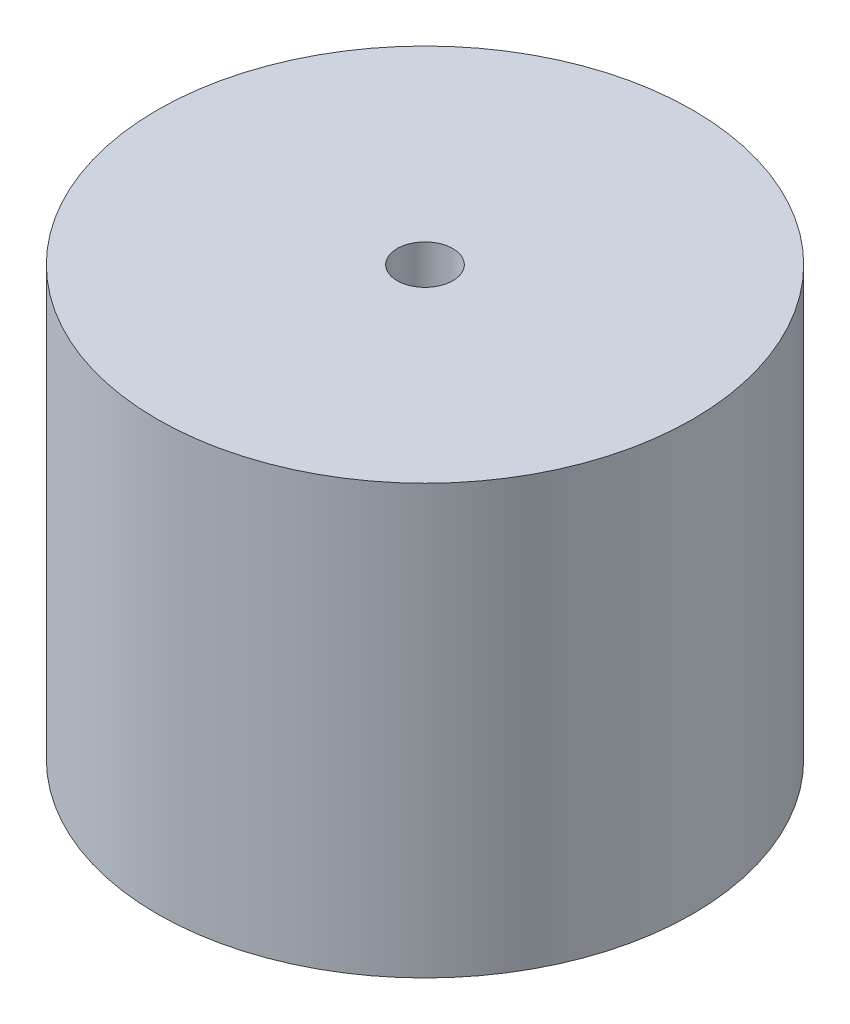
ISO-10303-21;
HEADER;
FILE_DESCRIPTION(('STEP AP214'),'2;1');
FILE_NAME('part.step','',(''),(''),'','','');
FILE_SCHEMA(('AUTOMOTIVE_DESIGN { 1 0 10303 214 1 1 1 1 }'));
ENDSEC;
DATA;
#1=APPLICATION_CONTEXT('core data for automotive mechanical design processes');
#2=APPLICATION_PROTOCOL_DEFINITION('international standard','automotive_design',2000,#1);
#3=PRODUCT_CONTEXT('',#1,'mechanical');
#4=PRODUCT('Part','Part','',(#3));
#5=PRODUCT_RELATED_PRODUCT_CATEGORY('part','',(#4));
#6=PRODUCT_DEFINITION_FORMATION('','',#4);
#7=PRODUCT_DEFINITION_CONTEXT('part definition',#1,'design');
#8=PRODUCT_DEFINITION('design','',#6,#7);
#9=PRODUCT_DEFINITION_SHAPE('','',#8);
#10=(LENGTH_UNIT() NAMED_UNIT(*) SI_UNIT(.MILLI.,.METRE.));
#11=(NAMED_UNIT(*) PLANE_ANGLE_UNIT() SI_UNIT($,.RADIAN.));
#12=(NAMED_UNIT(*) SI_UNIT($,.STERADIAN.) SOLID_ANGLE_UNIT());
#13=UNCERTAINTY_MEASURE_WITH_UNIT(LENGTH_MEASURE(1.E-05),#10,'distance_accuracy_value','');
#14=(GEOMETRIC_REPRESENTATION_CONTEXT(3) GLOBAL_UNCERTAINTY_ASSIGNED_CONTEXT((#13)) GLOBAL_UNIT_ASSIGNED_CONTEXT((#10,
#11,#12)) REPRESENTATION_CONTEXT('',''));
#15=CARTESIAN_POINT('',(0.,0.,0.));
#16=DIRECTION('',(0.,0.,1.));
#17=DIRECTION('',(1.,0.,0.));
#18=AXIS2_PLACEMENT_3D('',#15,#16,#17);
#19=CARTESIAN_POINT('',(-32.4400010499558,2.54,6.2787098806366));
#20=DIRECTION('',(0.,1.,0.));
#21=DIRECTION('',(0.,0.,1.));
#22=AXIS2_PLACEMENT_3D('',#19,#20,#21);
#23=PLANE('',#22);
#24=CARTESIAN_POINT('',(-32.4400010499558,2.54,6.2787098806366));
#25=DIRECTION('',(0.,1.,0.));
#26=DIRECTION('',(0.,0.,1.));
#27=AXIS2_PLACEMENT_3D('',#24,#25,#26);
#28=CIRCLE('',#27,3.175);
#29=CARTESIAN_POINT('',(-32.4400010499558,2.54,9.4537098806366));
#30=VERTEX_POINT('',#29);
#31=EDGE_CURVE('E10',#30,#30,#28,.T.);
#32=ORIENTED_EDGE('',*,*,#31,.T.);
#33=EDGE_LOOP('',(#32));
#34=FACE_BOUND('',#33,.T.);
#35=CARTESIAN_POINT('',(-32.4400010499558,2.54,6.2787098806366));
#36=DIRECTION('',(0.,1.,0.));
#37=DIRECTION('',(0.,0.,1.));
#38=AXIS2_PLACEMENT_3D('',#35,#36,#37);
#39=CIRCLE('',#38,0.330200000000003);
#40=CARTESIAN_POINT('',(-32.4400010499558,2.54,6.6089098806366));
#41=VERTEX_POINT('',#40);
#42=EDGE_CURVE('E38',#41,#41,#39,.T.);
#43=ORIENTED_EDGE('',*,*,#42,.F.);
#44=EDGE_LOOP('',(#43));
#45=FACE_BOUND('',#44,.T.);
#46=ADVANCED_FACE('F31',(#34,#45),#23,.T.);
#47=CARTESIAN_POINT('',(-32.4400010499558,2.54,6.2787098806366));
#48=DIRECTION('',(0.,-1.,0.));
#49=DIRECTION('',(0.,0.,-1.));
#50=AXIS2_PLACEMENT_3D('',#47,#48,#49);
#51=CYLINDRICAL_SURFACE('',#50,3.175);
#52=ORIENTED_EDGE('',*,*,#31,.F.);
#53=EDGE_LOOP('',(#52));
#54=FACE_BOUND('',#53,.T.);
#55=CARTESIAN_POINT('',(-32.4400010499558,-2.54,6.2787098806366));
#56=DIRECTION('',(0.,-1.,0.));
#57=DIRECTION('',(0.,0.,-1.));
#58=AXIS2_PLACEMENT_3D('',#55,#56,#57);
#59=CIRCLE('',#58,3.175);
#60=CARTESIAN_POINT('',(-32.4400010499558,-2.54,3.1037098806366));
#61=VERTEX_POINT('',#60);
#62=EDGE_CURVE('E47',#61,#61,#59,.T.);
#63=ORIENTED_EDGE('',*,*,#62,.F.);
#64=EDGE_LOOP('',(#63));
#65=FACE_BOUND('',#64,.T.);
#66=ADVANCED_FACE('F33',(#54,#65),#51,.T.);
#67=CARTESIAN_POINT('',(-32.4400010499558,2.54,6.2787098806366));
#68=DIRECTION('',(0.,-1.,0.));
#69=DIRECTION('',(0.,0.,-1.));
#70=AXIS2_PLACEMENT_3D('',#67,#68,#69);
#71=CYLINDRICAL_SURFACE('',#70,0.330200000000003);
#72=ORIENTED_EDGE('',*,*,#42,.T.);
#73=EDGE_LOOP('',(#72));
#74=FACE_BOUND('',#73,.T.);
#75=CARTESIAN_POINT('',(-32.4400010499558,0.,6.2787098806366));
#76=DIRECTION('',(0.,1.,0.));
#77=DIRECTION('',(0.,0.,1.));
#78=AXIS2_PLACEMENT_3D('',#75,#76,#77);
#79=CIRCLE('',#78,0.330200000000003);
#80=CARTESIAN_POINT('',(-32.4400010499558,0.,6.6089098806366));
#81=VERTEX_POINT('',#80);
#82=EDGE_CURVE('E42',#81,#81,#79,.T.);
#83=ORIENTED_EDGE('',*,*,#82,.F.);
#84=EDGE_LOOP('',(#83));
#85=FACE_BOUND('',#84,.T.);
#86=ADVANCED_FACE('F55',(#74,#85),#71,.F.);
#87=CARTESIAN_POINT('',(-32.4400010499558,0.,6.2787098806366));
#88=DIRECTION('',(0.,-1.,0.));
#89=DIRECTION('',(0.,0.,-1.));
#90=AXIS2_PLACEMENT_3D('',#87,#88,#89);
#91=PLANE('',#90);
#92=ORIENTED_EDGE('',*,*,#82,.T.);
#93=EDGE_LOOP('',(#92));
#94=FACE_BOUND('',#93,.T.);
#95=ADVANCED_FACE('F61',(#94),#91,.F.);
#96=CARTESIAN_POINT('',(-32.4400010499558,-2.54,6.2787098806366));
#97=DIRECTION('',(0.,-1.,0.));
#98=DIRECTION('',(0.,0.,-1.));
#99=AXIS2_PLACEMENT_3D('',#96,#97,#98);
#100=PLANE('',#99);
#101=ORIENTED_EDGE('',*,*,#62,.T.);
#102=EDGE_LOOP('',(#101));
#103=FACE_BOUND('',#102,.T.);
#104=ADVANCED_FACE('F52',(#103),#100,.T.);
#105=CLOSED_SHELL('',(#46,#66,#86,#95,#104));
#106=MANIFOLD_SOLID_BREP('B2',#105);
#107=ADVANCED_BREP_SHAPE_REPRESENTATION('',(#18,#106),#14);
#108=SHAPE_DEFINITION_REPRESENTATION(#9,#107);
ENDSEC;
END-ISO-10303-21;
